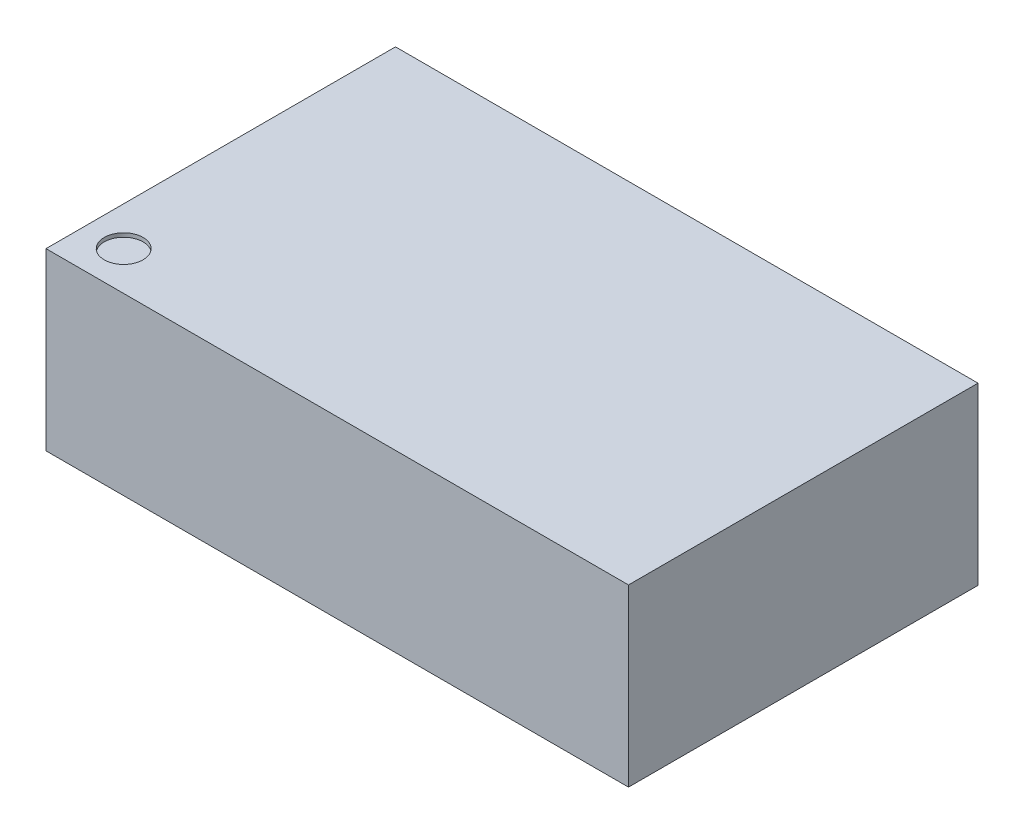
ISO-10303-21;
HEADER;
FILE_DESCRIPTION(('STEP AP214'),'2;1');
FILE_NAME('part.step','',(''),(''),'','','');
FILE_SCHEMA(('AUTOMOTIVE_DESIGN { 1 0 10303 214 1 1 1 1 }'));
ENDSEC;
DATA;
#1=APPLICATION_CONTEXT('core data for automotive mechanical design processes');
#2=APPLICATION_PROTOCOL_DEFINITION('international standard','automotive_design',2000,#1);
#3=PRODUCT_CONTEXT('',#1,'mechanical');
#4=PRODUCT('Part','Part','',(#3));
#5=PRODUCT_RELATED_PRODUCT_CATEGORY('part','',(#4));
#6=PRODUCT_DEFINITION_FORMATION('','',#4);
#7=PRODUCT_DEFINITION_CONTEXT('part definition',#1,'design');
#8=PRODUCT_DEFINITION('design','',#6,#7);
#9=PRODUCT_DEFINITION_SHAPE('','',#8);
#10=(LENGTH_UNIT() NAMED_UNIT(*) SI_UNIT(.MILLI.,.METRE.));
#11=(NAMED_UNIT(*) PLANE_ANGLE_UNIT() SI_UNIT($,.RADIAN.));
#12=(NAMED_UNIT(*) SI_UNIT($,.STERADIAN.) SOLID_ANGLE_UNIT());
#13=UNCERTAINTY_MEASURE_WITH_UNIT(LENGTH_MEASURE(1.E-05),#10,'distance_accuracy_value','');
#14=(GEOMETRIC_REPRESENTATION_CONTEXT(3) GLOBAL_UNCERTAINTY_ASSIGNED_CONTEXT((#13)) GLOBAL_UNIT_ASSIGNED_CONTEXT((#10,
#11,#12)) REPRESENTATION_CONTEXT('',''));
#15=CARTESIAN_POINT('',(0.,0.,0.));
#16=DIRECTION('',(0.,0.,1.));
#17=DIRECTION('',(1.,0.,0.));
#18=AXIS2_PLACEMENT_3D('',#15,#16,#17);
#19=CARTESIAN_POINT('',(7.5,4.51,4.5));
#20=DIRECTION('',(-1.,0.,0.));
#21=DIRECTION('',(0.,0.,1.));
#22=AXIS2_PLACEMENT_3D('',#19,#20,#21);
#23=PLANE('',#22);
#24=DIRECTION('',(0.,0.,-1.));
#25=VECTOR('',#24,1.);
#26=CARTESIAN_POINT('',(7.5,0.,4.5));
#27=LINE('',#26,#25);
#28=CARTESIAN_POINT('',(7.5,0.,4.5));
#29=VERTEX_POINT('',#28);
#30=CARTESIAN_POINT('',(7.5,0.,-4.5));
#31=VERTEX_POINT('',#30);
#32=EDGE_CURVE('E109',#29,#31,#27,.T.);
#33=ORIENTED_EDGE('',*,*,#32,.T.);
#34=DIRECTION('',(0.,-1.,0.));
#35=VECTOR('',#34,1.);
#36=CARTESIAN_POINT('',(7.5,4.51,-4.5));
#37=LINE('',#36,#35);
#38=CARTESIAN_POINT('',(7.5,4.51,-4.5));
#39=VERTEX_POINT('',#38);
#40=EDGE_CURVE('E11',#39,#31,#37,.T.);
#41=ORIENTED_EDGE('',*,*,#40,.F.);
#42=DIRECTION('',(0.,0.,-1.));
#43=VECTOR('',#42,1.);
#44=CARTESIAN_POINT('',(7.5,4.51,4.5));
#45=LINE('',#44,#43);
#46=CARTESIAN_POINT('',(7.5,4.51,4.5));
#47=VERTEX_POINT('',#46);
#48=EDGE_CURVE('E93',#47,#39,#45,.T.);
#49=ORIENTED_EDGE('',*,*,#48,.F.);
#50=DIRECTION('',(0.,-1.,0.));
#51=VECTOR('',#50,1.);
#52=CARTESIAN_POINT('',(7.5,4.51,4.5));
#53=LINE('',#52,#51);
#54=EDGE_CURVE('E105',#47,#29,#53,.T.);
#55=ORIENTED_EDGE('',*,*,#54,.T.);
#56=EDGE_LOOP('',(#33,#41,#49,#55));
#57=FACE_BOUND('',#56,.T.);
#58=ADVANCED_FACE('F41',(#57),#23,.F.);
#59=CARTESIAN_POINT('',(-7.5,4.51,-4.5));
#60=DIRECTION('',(0.,0.,1.));
#61=DIRECTION('',(1.,0.,0.));
#62=AXIS2_PLACEMENT_3D('',#59,#60,#61);
#63=PLANE('',#62);
#64=DIRECTION('',(-1.,0.,0.));
#65=VECTOR('',#64,1.);
#66=CARTESIAN_POINT('',(-7.5,0.,-4.5));
#67=LINE('',#66,#65);
#68=CARTESIAN_POINT('',(-7.5,0.,-4.5));
#69=VERTEX_POINT('',#68);
#70=EDGE_CURVE('E98',#31,#69,#67,.T.);
#71=ORIENTED_EDGE('',*,*,#70,.T.);
#72=DIRECTION('',(0.,-1.,0.));
#73=VECTOR('',#72,1.);
#74=CARTESIAN_POINT('',(-7.5,4.51,-4.5));
#75=LINE('',#74,#73);
#76=CARTESIAN_POINT('',(-7.5,4.51,-4.5));
#77=VERTEX_POINT('',#76);
#78=EDGE_CURVE('E50',#77,#69,#75,.T.);
#79=ORIENTED_EDGE('',*,*,#78,.F.);
#80=DIRECTION('',(-1.,0.,0.));
#81=VECTOR('',#80,1.);
#82=CARTESIAN_POINT('',(-7.5,4.51,-4.5));
#83=LINE('',#82,#81);
#84=EDGE_CURVE('E88',#39,#77,#83,.T.);
#85=ORIENTED_EDGE('',*,*,#84,.F.);
#86=ORIENTED_EDGE('',*,*,#40,.T.);
#87=EDGE_LOOP('',(#71,#79,#85,#86));
#88=FACE_BOUND('',#87,.T.);
#89=ADVANCED_FACE('F97',(#88),#63,.F.);
#90=CARTESIAN_POINT('',(-7.5,4.51,4.5));
#91=DIRECTION('',(1.,0.,0.));
#92=DIRECTION('',(0.,0.,-1.));
#93=AXIS2_PLACEMENT_3D('',#90,#91,#92);
#94=PLANE('',#93);
#95=DIRECTION('',(0.,0.,1.));
#96=VECTOR('',#95,1.);
#97=CARTESIAN_POINT('',(-7.5,0.,4.5));
#98=LINE('',#97,#96);
#99=CARTESIAN_POINT('',(-7.5,0.,4.5));
#100=VERTEX_POINT('',#99);
#101=EDGE_CURVE('E75',#69,#100,#98,.T.);
#102=ORIENTED_EDGE('',*,*,#101,.T.);
#103=DIRECTION('',(0.,-1.,0.));
#104=VECTOR('',#103,1.);
#105=CARTESIAN_POINT('',(-7.5,4.51,4.5));
#106=LINE('',#105,#104);
#107=CARTESIAN_POINT('',(-7.5,4.51,4.5));
#108=VERTEX_POINT('',#107);
#109=EDGE_CURVE('E100',#108,#100,#106,.T.);
#110=ORIENTED_EDGE('',*,*,#109,.F.);
#111=DIRECTION('',(0.,0.,1.));
#112=VECTOR('',#111,1.);
#113=CARTESIAN_POINT('',(-7.5,4.51,4.5));
#114=LINE('',#113,#112);
#115=EDGE_CURVE('E91',#77,#108,#114,.T.);
#116=ORIENTED_EDGE('',*,*,#115,.F.);
#117=ORIENTED_EDGE('',*,*,#78,.T.);
#118=EDGE_LOOP('',(#102,#110,#116,#117));
#119=FACE_BOUND('',#118,.T.);
#120=ADVANCED_FACE('F101',(#119),#94,.F.);
#121=CARTESIAN_POINT('',(-7.5,4.51,4.5));
#122=DIRECTION('',(0.,0.,-1.));
#123=DIRECTION('',(-1.,0.,0.));
#124=AXIS2_PLACEMENT_3D('',#121,#122,#123);
#125=PLANE('',#124);
#126=DIRECTION('',(1.,0.,0.));
#127=VECTOR('',#126,1.);
#128=CARTESIAN_POINT('',(-7.5,0.,4.5));
#129=LINE('',#128,#127);
#130=EDGE_CURVE('E81',#100,#29,#129,.T.);
#131=ORIENTED_EDGE('',*,*,#130,.T.);
#132=ORIENTED_EDGE('',*,*,#54,.F.);
#133=DIRECTION('',(1.,0.,0.));
#134=VECTOR('',#133,1.);
#135=CARTESIAN_POINT('',(-7.5,4.51,4.5));
#136=LINE('',#135,#134);
#137=EDGE_CURVE('E58',#108,#47,#136,.T.);
#138=ORIENTED_EDGE('',*,*,#137,.F.);
#139=ORIENTED_EDGE('',*,*,#109,.T.);
#140=EDGE_LOOP('',(#131,#132,#138,#139));
#141=FACE_BOUND('',#140,.T.);
#142=ADVANCED_FACE('F123',(#141),#125,.F.);
#143=CARTESIAN_POINT('',(0.,4.51,0.));
#144=DIRECTION('',(0.,-1.,0.));
#145=DIRECTION('',(0.,0.,-1.));
#146=AXIS2_PLACEMENT_3D('',#143,#144,#145);
#147=PLANE('',#146);
#148=CARTESIAN_POINT('',(-6.5,4.51,3.5));
#149=DIRECTION('',(0.,1.,0.));
#150=DIRECTION('',(0.,0.,1.));
#151=AXIS2_PLACEMENT_3D('',#148,#149,#150);
#152=CIRCLE('',#151,0.500000000000001);
#153=CARTESIAN_POINT('',(-6.5,4.51,4.));
#154=VERTEX_POINT('',#153);
#155=EDGE_CURVE('E130',#154,#154,#152,.T.);
#156=ORIENTED_EDGE('',*,*,#155,.F.);
#157=EDGE_LOOP('',(#156));
#158=FACE_BOUND('',#157,.T.);
#159=ORIENTED_EDGE('',*,*,#48,.T.);
#160=ORIENTED_EDGE('',*,*,#84,.T.);
#161=ORIENTED_EDGE('',*,*,#115,.T.);
#162=ORIENTED_EDGE('',*,*,#137,.T.);
#163=EDGE_LOOP('',(#159,#160,#161,#162));
#164=FACE_BOUND('',#163,.T.);
#165=ADVANCED_FACE('F89',(#158,#164),#147,.F.);
#166=CARTESIAN_POINT('',(0.,0.,0.));
#167=DIRECTION('',(0.,-1.,0.));
#168=DIRECTION('',(0.,0.,-1.));
#169=AXIS2_PLACEMENT_3D('',#166,#167,#168);
#170=PLANE('',#169);
#171=ORIENTED_EDGE('',*,*,#32,.F.);
#172=ORIENTED_EDGE('',*,*,#130,.F.);
#173=ORIENTED_EDGE('',*,*,#101,.F.);
#174=ORIENTED_EDGE('',*,*,#70,.F.);
#175=EDGE_LOOP('',(#171,#172,#173,#174));
#176=FACE_BOUND('',#175,.T.);
#177=ADVANCED_FACE('F126',(#176),#170,.T.);
#178=CARTESIAN_POINT('',(-6.5,4.41,3.5));
#179=DIRECTION('',(0.,1.,0.));
#180=DIRECTION('',(0.,0.,1.));
#181=AXIS2_PLACEMENT_3D('',#178,#179,#180);
#182=CYLINDRICAL_SURFACE('',#181,0.500000000000001);
#183=CARTESIAN_POINT('',(-6.5,4.41,3.5));
#184=DIRECTION('',(0.,1.,0.));
#185=DIRECTION('',(0.,0.,1.));
#186=AXIS2_PLACEMENT_3D('',#183,#184,#185);
#187=CIRCLE('',#186,0.500000000000001);
#188=CARTESIAN_POINT('',(-6.5,4.41,4.));
#189=VERTEX_POINT('',#188);
#190=EDGE_CURVE('E113',#189,#189,#187,.T.);
#191=ORIENTED_EDGE('',*,*,#190,.F.);
#192=EDGE_LOOP('',(#191));
#193=FACE_BOUND('',#192,.T.);
#194=ORIENTED_EDGE('',*,*,#155,.T.);
#195=EDGE_LOOP('',(#194));
#196=FACE_BOUND('',#195,.T.);
#197=ADVANCED_FACE('F140',(#193,#196),#182,.F.);
#198=CARTESIAN_POINT('',(-6.5,4.41,3.5));
#199=DIRECTION('',(0.,1.,0.));
#200=DIRECTION('',(0.,0.,1.));
#201=AXIS2_PLACEMENT_3D('',#198,#199,#200);
#202=PLANE('',#201);
#203=ORIENTED_EDGE('',*,*,#190,.T.);
#204=EDGE_LOOP('',(#203));
#205=FACE_BOUND('',#204,.T.);
#206=ADVANCED_FACE('F138',(#205),#202,.T.);
#207=CLOSED_SHELL('',(#58,#89,#120,#142,#165,#177,#197,#206));
#208=MANIFOLD_SOLID_BREP('B2',#207);
#209=ADVANCED_BREP_SHAPE_REPRESENTATION('',(#18,#208),#14);
#210=SHAPE_DEFINITION_REPRESENTATION(#9,#209);
ENDSEC;
END-ISO-10303-21;
